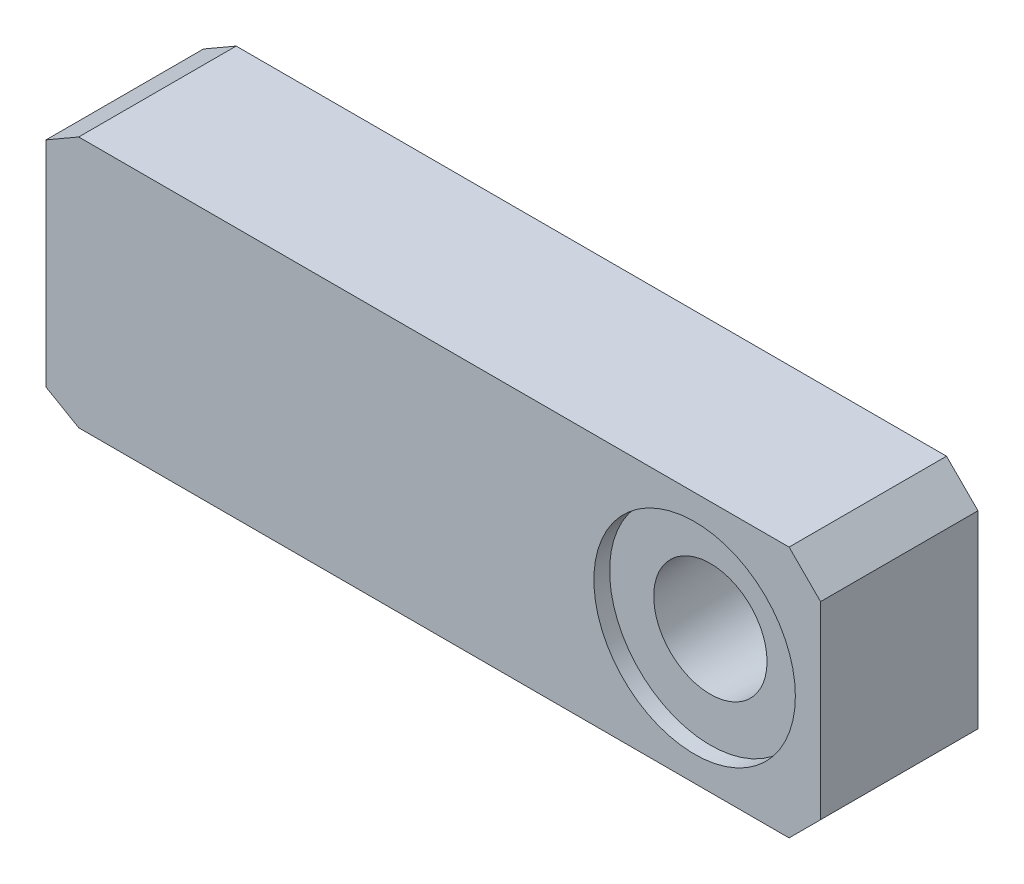
ISO-10303-21;
HEADER;
FILE_DESCRIPTION(('STEP AP214'),'2;1');
FILE_NAME('part.step','',(''),(''),'','','');
FILE_SCHEMA(('AUTOMOTIVE_DESIGN { 1 0 10303 214 1 1 1 1 }'));
ENDSEC;
DATA;
#1=APPLICATION_CONTEXT('core data for automotive mechanical design processes');
#2=APPLICATION_PROTOCOL_DEFINITION('international standard','automotive_design',2000,#1);
#3=PRODUCT_CONTEXT('',#1,'mechanical');
#4=PRODUCT('Part','Part','',(#3));
#5=PRODUCT_RELATED_PRODUCT_CATEGORY('part','',(#4));
#6=PRODUCT_DEFINITION_FORMATION('','',#4);
#7=PRODUCT_DEFINITION_CONTEXT('part definition',#1,'design');
#8=PRODUCT_DEFINITION('design','',#6,#7);
#9=PRODUCT_DEFINITION_SHAPE('','',#8);
#10=(LENGTH_UNIT() NAMED_UNIT(*) SI_UNIT(.MILLI.,.METRE.));
#11=(NAMED_UNIT(*) PLANE_ANGLE_UNIT() SI_UNIT($,.RADIAN.));
#12=(NAMED_UNIT(*) SI_UNIT($,.STERADIAN.) SOLID_ANGLE_UNIT());
#13=UNCERTAINTY_MEASURE_WITH_UNIT(LENGTH_MEASURE(1.E-05),#10,'distance_accuracy_value','');
#14=(GEOMETRIC_REPRESENTATION_CONTEXT(3) GLOBAL_UNCERTAINTY_ASSIGNED_CONTEXT((#13)) GLOBAL_UNIT_ASSIGNED_CONTEXT((#10,
#11,#12)) REPRESENTATION_CONTEXT('',''));
#15=CARTESIAN_POINT('',(0.,0.,0.));
#16=DIRECTION('',(0.,0.,1.));
#17=DIRECTION('',(1.,0.,0.));
#18=AXIS2_PLACEMENT_3D('',#15,#16,#17);
#19=CARTESIAN_POINT('',(0.,-20.,12.5));
#20=DIRECTION('',(1.,0.,0.));
#21=DIRECTION('',(0.,1.,0.));
#22=AXIS2_PLACEMENT_3D('',#19,#20,#21);
#23=PLANE('',#22);
#24=DIRECTION('',(0.,-1.,0.));
#25=VECTOR('',#24,1.);
#26=CARTESIAN_POINT('',(0.,-20.,-12.5));
#27=LINE('',#26,#25);
#28=CARTESIAN_POINT('',(0.,17.,-12.5));
#29=VERTEX_POINT('',#28);
#30=CARTESIAN_POINT('',(0.,-17.,-12.5));
#31=VERTEX_POINT('',#30);
#32=EDGE_CURVE('E124',#29,#31,#27,.T.);
#33=ORIENTED_EDGE('',*,*,#32,.T.);
#34=DIRECTION('',(0.,0.,1.));
#35=VECTOR('',#34,1.);
#36=CARTESIAN_POINT('',(0.,-17.,12.5));
#37=LINE('',#36,#35);
#38=CARTESIAN_POINT('',(0.,-17.,12.5));
#39=VERTEX_POINT('',#38);
#40=EDGE_CURVE('E107',#31,#39,#37,.T.);
#41=ORIENTED_EDGE('',*,*,#40,.T.);
#42=DIRECTION('',(0.,-1.,0.));
#43=VECTOR('',#42,1.);
#44=CARTESIAN_POINT('',(0.,-20.,12.5));
#45=LINE('',#44,#43);
#46=CARTESIAN_POINT('',(0.,17.,12.5));
#47=VERTEX_POINT('',#46);
#48=EDGE_CURVE('E133',#47,#39,#45,.T.);
#49=ORIENTED_EDGE('',*,*,#48,.F.);
#50=DIRECTION('',(0.,0.,-1.));
#51=VECTOR('',#50,1.);
#52=CARTESIAN_POINT('',(0.,17.,12.5));
#53=LINE('',#52,#51);
#54=EDGE_CURVE('E112',#47,#29,#53,.T.);
#55=ORIENTED_EDGE('',*,*,#54,.T.);
#56=EDGE_LOOP('',(#33,#41,#49,#55));
#57=FACE_BOUND('',#56,.T.);
#58=ADVANCED_FACE('F34',(#57),#23,.F.);
#59=CARTESIAN_POINT('',(0.,-20.,12.5));
#60=DIRECTION('',(0.,1.,0.));
#61=DIRECTION('',(-1.,0.,0.));
#62=AXIS2_PLACEMENT_3D('',#59,#60,#61);
#63=PLANE('',#62);
#64=DIRECTION('',(1.,0.,0.));
#65=VECTOR('',#64,1.);
#66=CARTESIAN_POINT('',(0.,-20.,-12.5));
#67=LINE('',#66,#65);
#68=CARTESIAN_POINT('',(5.1961524227066,-20.,-12.5));
#69=VERTEX_POINT('',#68);
#70=CARTESIAN_POINT('',(118.,-20.,-12.5));
#71=VERTEX_POINT('',#70);
#72=EDGE_CURVE('E116',#69,#71,#67,.T.);
#73=ORIENTED_EDGE('',*,*,#72,.T.);
#74=DIRECTION('',(0.,0.,1.));
#75=VECTOR('',#74,1.);
#76=CARTESIAN_POINT('',(118.,-20.,12.5));
#77=LINE('',#76,#75);
#78=CARTESIAN_POINT('',(118.,-20.,12.5));
#79=VERTEX_POINT('',#78);
#80=EDGE_CURVE('E57',#71,#79,#77,.T.);
#81=ORIENTED_EDGE('',*,*,#80,.T.);
#82=DIRECTION('',(1.,0.,0.));
#83=VECTOR('',#82,1.);
#84=CARTESIAN_POINT('',(0.,-20.,12.5));
#85=LINE('',#84,#83);
#86=CARTESIAN_POINT('',(5.1961524227066,-20.,12.5));
#87=VERTEX_POINT('',#86);
#88=EDGE_CURVE('E117',#87,#79,#85,.T.);
#89=ORIENTED_EDGE('',*,*,#88,.F.);
#90=DIRECTION('',(0.,0.,-1.));
#91=VECTOR('',#90,1.);
#92=CARTESIAN_POINT('',(5.1961524227066,-20.,12.5));
#93=LINE('',#92,#91);
#94=EDGE_CURVE('E106',#87,#69,#93,.T.);
#95=ORIENTED_EDGE('',*,*,#94,.T.);
#96=EDGE_LOOP('',(#73,#81,#89,#95));
#97=FACE_BOUND('',#96,.T.);
#98=ADVANCED_FACE('F115',(#97),#63,.F.);
#99=CARTESIAN_POINT('',(123.,-20.,12.5));
#100=DIRECTION('',(-1.,0.,0.));
#101=DIRECTION('',(0.,-1.,0.));
#102=AXIS2_PLACEMENT_3D('',#99,#100,#101);
#103=PLANE('',#102);
#104=DIRECTION('',(0.,1.,0.));
#105=VECTOR('',#104,1.);
#106=CARTESIAN_POINT('',(123.,-20.,12.5));
#107=LINE('',#106,#105);
#108=CARTESIAN_POINT('',(123.,-14.9999999999999,12.5));
#109=VERTEX_POINT('',#108);
#110=CARTESIAN_POINT('',(123.,15.,12.5));
#111=VERTEX_POINT('',#110);
#112=EDGE_CURVE('E159',#109,#111,#107,.T.);
#113=ORIENTED_EDGE('',*,*,#112,.F.);
#114=DIRECTION('',(0.,0.,-1.));
#115=VECTOR('',#114,1.);
#116=CARTESIAN_POINT('',(123.,-14.9999999999999,12.5));
#117=LINE('',#116,#115);
#118=CARTESIAN_POINT('',(123.,-14.9999999999999,-12.5));
#119=VERTEX_POINT('',#118);
#120=EDGE_CURVE('E149',#109,#119,#117,.T.);
#121=ORIENTED_EDGE('',*,*,#120,.T.);
#122=DIRECTION('',(0.,1.,0.));
#123=VECTOR('',#122,1.);
#124=CARTESIAN_POINT('',(123.,-20.,-12.5));
#125=LINE('',#124,#123);
#126=CARTESIAN_POINT('',(123.,15.,-12.5));
#127=VERTEX_POINT('',#126);
#128=EDGE_CURVE('E123',#119,#127,#125,.T.);
#129=ORIENTED_EDGE('',*,*,#128,.T.);
#130=DIRECTION('',(0.,0.,1.));
#131=VECTOR('',#130,1.);
#132=CARTESIAN_POINT('',(123.,15.,12.5));
#133=LINE('',#132,#131);
#134=EDGE_CURVE('E147',#127,#111,#133,.T.);
#135=ORIENTED_EDGE('',*,*,#134,.T.);
#136=EDGE_LOOP('',(#113,#121,#129,#135));
#137=FACE_BOUND('',#136,.T.);
#138=ADVANCED_FACE('F163',(#137),#103,.F.);
#139=CARTESIAN_POINT('',(0.,20.,12.5));
#140=DIRECTION('',(0.,-1.,0.));
#141=DIRECTION('',(0.,0.,-1.));
#142=AXIS2_PLACEMENT_3D('',#139,#140,#141);
#143=PLANE('',#142);
#144=DIRECTION('',(-1.,0.,0.));
#145=VECTOR('',#144,1.);
#146=CARTESIAN_POINT('',(0.,20.,12.5));
#147=LINE('',#146,#145);
#148=CARTESIAN_POINT('',(118.,20.,12.5));
#149=VERTEX_POINT('',#148);
#150=CARTESIAN_POINT('',(5.19615242270665,20.,12.5));
#151=VERTEX_POINT('',#150);
#152=EDGE_CURVE('E118',#149,#151,#147,.T.);
#153=ORIENTED_EDGE('',*,*,#152,.F.);
#154=DIRECTION('',(0.,0.,-1.));
#155=VECTOR('',#154,1.);
#156=CARTESIAN_POINT('',(118.,20.,12.5));
#157=LINE('',#156,#155);
#158=CARTESIAN_POINT('',(118.,20.,-12.5));
#159=VERTEX_POINT('',#158);
#160=EDGE_CURVE('E11',#149,#159,#157,.T.);
#161=ORIENTED_EDGE('',*,*,#160,.T.);
#162=DIRECTION('',(-1.,0.,0.));
#163=VECTOR('',#162,1.);
#164=CARTESIAN_POINT('',(0.,20.,-12.5));
#165=LINE('',#164,#163);
#166=CARTESIAN_POINT('',(5.19615242270665,20.,-12.5));
#167=VERTEX_POINT('',#166);
#168=EDGE_CURVE('E127',#159,#167,#165,.T.);
#169=ORIENTED_EDGE('',*,*,#168,.T.);
#170=DIRECTION('',(0.,0.,1.));
#171=VECTOR('',#170,1.);
#172=CARTESIAN_POINT('',(5.19615242270665,20.,12.5));
#173=LINE('',#172,#171);
#174=EDGE_CURVE('E144',#167,#151,#173,.T.);
#175=ORIENTED_EDGE('',*,*,#174,.T.);
#176=EDGE_LOOP('',(#153,#161,#169,#175));
#177=FACE_BOUND('',#176,.T.);
#178=ADVANCED_FACE('F215',(#177),#143,.F.);
#179=CARTESIAN_POINT('',(0.,0.,12.5));
#180=DIRECTION('',(0.,0.,-1.));
#181=DIRECTION('',(-1.,0.,0.));
#182=AXIS2_PLACEMENT_3D('',#179,#180,#181);
#183=PLANE('',#182);
#184=CARTESIAN_POINT('',(103.,0.,12.5));
#185=DIRECTION('',(0.,0.,1.));
#186=DIRECTION('',(1.,0.,0.));
#187=AXIS2_PLACEMENT_3D('',#184,#185,#186);
#188=CIRCLE('',#187,16.);
#189=CARTESIAN_POINT('',(119.,0.,12.5));
#190=VERTEX_POINT('',#189);
#191=EDGE_CURVE('E129',#190,#190,#188,.T.);
#192=ORIENTED_EDGE('',*,*,#191,.F.);
#193=EDGE_LOOP('',(#192));
#194=FACE_BOUND('',#193,.T.);
#195=ORIENTED_EDGE('',*,*,#88,.T.);
#196=DIRECTION('',(-0.707106781186547,-0.707106781186548,0.));
#197=VECTOR('',#196,1.);
#198=CARTESIAN_POINT('',(123.,-14.9999999999999,12.5));
#199=LINE('',#198,#197);
#200=EDGE_CURVE('E42',#79,#109,#199,.F.);
#201=ORIENTED_EDGE('',*,*,#200,.T.);
#202=ORIENTED_EDGE('',*,*,#112,.T.);
#203=DIRECTION('',(0.707106781186549,-0.707106781186547,0.));
#204=VECTOR('',#203,1.);
#205=CARTESIAN_POINT('',(118.,20.,12.5));
#206=LINE('',#205,#204);
#207=EDGE_CURVE('E49',#111,#149,#206,.F.);
#208=ORIENTED_EDGE('',*,*,#207,.T.);
#209=ORIENTED_EDGE('',*,*,#152,.T.);
#210=DIRECTION('',(0.866025403784439,0.5,0.));
#211=VECTOR('',#210,1.);
#212=CARTESIAN_POINT('',(0.,17.,12.5));
#213=LINE('',#212,#211);
#214=EDGE_CURVE('E140',#151,#47,#213,.F.);
#215=ORIENTED_EDGE('',*,*,#214,.T.);
#216=ORIENTED_EDGE('',*,*,#48,.T.);
#217=DIRECTION('',(-0.866025403784437,0.500000000000003,0.));
#218=VECTOR('',#217,1.);
#219=CARTESIAN_POINT('',(5.1961524227066,-20.,12.5));
#220=LINE('',#219,#218);
#221=EDGE_CURVE('E142',#39,#87,#220,.F.);
#222=ORIENTED_EDGE('',*,*,#221,.T.);
#223=EDGE_LOOP('',(#195,#201,#202,#208,#209,#215,#216,#222));
#224=FACE_BOUND('',#223,.T.);
#225=ADVANCED_FACE('F158',(#194,#224),#183,.F.);
#226=CARTESIAN_POINT('',(0.,0.,-12.5));
#227=DIRECTION('',(0.,0.,-1.));
#228=DIRECTION('',(-1.,0.,0.));
#229=AXIS2_PLACEMENT_3D('',#226,#227,#228);
#230=PLANE('',#229);
#231=CARTESIAN_POINT('',(103.,0.,-12.5));
#232=DIRECTION('',(0.,0.,1.));
#233=DIRECTION('',(1.,0.,0.));
#234=AXIS2_PLACEMENT_3D('',#231,#232,#233);
#235=CIRCLE('',#234,16.);
#236=CARTESIAN_POINT('',(119.,0.,-12.5));
#237=VERTEX_POINT('',#236);
#238=EDGE_CURVE('E328',#237,#237,#235,.T.);
#239=ORIENTED_EDGE('',*,*,#238,.T.);
#240=EDGE_LOOP('',(#239));
#241=FACE_BOUND('',#240,.T.);
#242=ORIENTED_EDGE('',*,*,#128,.F.);
#243=DIRECTION('',(0.707106781186547,0.707106781186548,0.));
#244=VECTOR('',#243,1.);
#245=CARTESIAN_POINT('',(69.,-69.,-12.5));
#246=LINE('',#245,#244);
#247=EDGE_CURVE('E122',#119,#71,#246,.F.);
#248=ORIENTED_EDGE('',*,*,#247,.T.);
#249=ORIENTED_EDGE('',*,*,#72,.F.);
#250=DIRECTION('',(0.866025403784437,-0.500000000000003,0.));
#251=VECTOR('',#250,1.);
#252=CARTESIAN_POINT('',(-7.36121593216775,-12.75,-12.5));
#253=LINE('',#252,#251);
#254=EDGE_CURVE('E102',#69,#31,#253,.F.);
#255=ORIENTED_EDGE('',*,*,#254,.T.);
#256=ORIENTED_EDGE('',*,*,#32,.F.);
#257=DIRECTION('',(-0.866025403784439,-0.5,0.));
#258=VECTOR('',#257,1.);
#259=CARTESIAN_POINT('',(-7.36121593216773,12.75,-12.5));
#260=LINE('',#259,#258);
#261=EDGE_CURVE('E113',#29,#167,#260,.F.);
#262=ORIENTED_EDGE('',*,*,#261,.T.);
#263=ORIENTED_EDGE('',*,*,#168,.F.);
#264=DIRECTION('',(-0.707106781186549,0.707106781186547,0.));
#265=VECTOR('',#264,1.);
#266=CARTESIAN_POINT('',(68.9999999999998,69.,-12.5));
#267=LINE('',#266,#265);
#268=EDGE_CURVE('E152',#159,#127,#267,.F.);
#269=ORIENTED_EDGE('',*,*,#268,.T.);
#270=EDGE_LOOP('',(#242,#248,#249,#255,#256,#262,#263,#269));
#271=FACE_BOUND('',#270,.T.);
#272=ADVANCED_FACE('F121',(#241,#271),#230,.T.);
#273=CARTESIAN_POINT('',(103.,0.,15.136672694938));
#274=DIRECTION('',(0.,0.,1.));
#275=DIRECTION('',(1.,0.,0.));
#276=AXIS2_PLACEMENT_3D('',#273,#274,#275);
#277=CYLINDRICAL_SURFACE('',#276,16.);
#278=ORIENTED_EDGE('',*,*,#191,.T.);
#279=EDGE_LOOP('',(#278));
#280=FACE_BOUND('',#279,.T.);
#281=CARTESIAN_POINT('',(103.,0.,10.));
#282=DIRECTION('',(0.,0.,1.));
#283=DIRECTION('',(1.,0.,0.));
#284=AXIS2_PLACEMENT_3D('',#281,#282,#283);
#285=CIRCLE('',#284,16.);
#286=CARTESIAN_POINT('',(119.,0.,10.));
#287=VERTEX_POINT('',#286);
#288=EDGE_CURVE('E317',#287,#287,#285,.T.);
#289=ORIENTED_EDGE('',*,*,#288,.F.);
#290=EDGE_LOOP('',(#289));
#291=FACE_BOUND('',#290,.T.);
#292=ADVANCED_FACE('F208',(#280,#291),#277,.F.);
#293=CARTESIAN_POINT('',(87.,0.,10.));
#294=DIRECTION('',(0.,0.,1.));
#295=DIRECTION('',(1.,0.,0.));
#296=AXIS2_PLACEMENT_3D('',#293,#294,#295);
#297=PLANE('',#296);
#298=ORIENTED_EDGE('',*,*,#288,.T.);
#299=EDGE_LOOP('',(#298));
#300=FACE_BOUND('',#299,.T.);
#301=CARTESIAN_POINT('',(103.,0.,10.));
#302=DIRECTION('',(0.,0.,1.));
#303=DIRECTION('',(1.,0.,0.));
#304=AXIS2_PLACEMENT_3D('',#301,#302,#303);
#305=CIRCLE('',#304,8.99999999999999);
#306=CARTESIAN_POINT('',(112.,0.,10.));
#307=VERTEX_POINT('',#306);
#308=EDGE_CURVE('E320',#307,#307,#305,.T.);
#309=ORIENTED_EDGE('',*,*,#308,.F.);
#310=EDGE_LOOP('',(#309));
#311=FACE_BOUND('',#310,.T.);
#312=ADVANCED_FACE('F204',(#300,#311),#297,.T.);
#313=CARTESIAN_POINT('',(103.,0.,-10.));
#314=DIRECTION('',(0.,0.,-1.));
#315=DIRECTION('',(-1.,0.,0.));
#316=AXIS2_PLACEMENT_3D('',#313,#314,#315);
#317=CONICAL_SURFACE('',#316,9.99999999999999,0.0499583957219428);
#318=ORIENTED_EDGE('',*,*,#308,.T.);
#319=EDGE_LOOP('',(#318));
#320=FACE_BOUND('',#319,.T.);
#321=CARTESIAN_POINT('',(103.,0.,-10.));
#322=DIRECTION('',(0.,0.,1.));
#323=DIRECTION('',(1.,0.,0.));
#324=AXIS2_PLACEMENT_3D('',#321,#322,#323);
#325=CIRCLE('',#324,9.99999999999999);
#326=CARTESIAN_POINT('',(113.,0.,-10.));
#327=VERTEX_POINT('',#326);
#328=EDGE_CURVE('E323',#327,#327,#325,.T.);
#329=ORIENTED_EDGE('',*,*,#328,.F.);
#330=EDGE_LOOP('',(#329));
#331=FACE_BOUND('',#330,.T.);
#332=ADVANCED_FACE('F196',(#320,#331),#317,.F.);
#333=CARTESIAN_POINT('',(93.,0.,-10.));
#334=DIRECTION('',(0.,0.,-1.));
#335=DIRECTION('',(-1.,0.,0.));
#336=AXIS2_PLACEMENT_3D('',#333,#334,#335);
#337=PLANE('',#336);
#338=ORIENTED_EDGE('',*,*,#328,.T.);
#339=EDGE_LOOP('',(#338));
#340=FACE_BOUND('',#339,.T.);
#341=CARTESIAN_POINT('',(103.,0.,-10.));
#342=DIRECTION('',(0.,0.,1.));
#343=DIRECTION('',(1.,0.,0.));
#344=AXIS2_PLACEMENT_3D('',#341,#342,#343);
#345=CIRCLE('',#344,16.);
#346=CARTESIAN_POINT('',(119.,0.,-10.));
#347=VERTEX_POINT('',#346);
#348=EDGE_CURVE('E326',#347,#347,#345,.T.);
#349=ORIENTED_EDGE('',*,*,#348,.F.);
#350=EDGE_LOOP('',(#349));
#351=FACE_BOUND('',#350,.T.);
#352=ADVANCED_FACE('F190',(#340,#351),#337,.T.);
#353=CARTESIAN_POINT('',(103.,0.,15.136672694938));
#354=DIRECTION('',(0.,0.,1.));
#355=DIRECTION('',(1.,0.,0.));
#356=AXIS2_PLACEMENT_3D('',#353,#354,#355);
#357=CYLINDRICAL_SURFACE('',#356,16.);
#358=ORIENTED_EDGE('',*,*,#348,.T.);
#359=EDGE_LOOP('',(#358));
#360=FACE_BOUND('',#359,.T.);
#361=ORIENTED_EDGE('',*,*,#238,.F.);
#362=EDGE_LOOP('',(#361));
#363=FACE_BOUND('',#362,.T.);
#364=ADVANCED_FACE('F186',(#360,#363),#357,.F.);
#365=CARTESIAN_POINT('',(5.1961524227066,-20.,12.5));
#366=DIRECTION('',(0.500000000000003,0.866025403784437,0.));
#367=DIRECTION('',(0.,0.,-1.));
#368=AXIS2_PLACEMENT_3D('',#365,#366,#367);
#369=PLANE('',#368);
#370=ORIENTED_EDGE('',*,*,#221,.F.);
#371=ORIENTED_EDGE('',*,*,#40,.F.);
#372=ORIENTED_EDGE('',*,*,#254,.F.);
#373=ORIENTED_EDGE('',*,*,#94,.F.);
#374=EDGE_LOOP('',(#370,#371,#372,#373));
#375=FACE_BOUND('',#374,.T.);
#376=ADVANCED_FACE('F105',(#375),#369,.F.);
#377=CARTESIAN_POINT('',(0.,17.,12.5));
#378=DIRECTION('',(0.5,-0.866025403784438,0.));
#379=DIRECTION('',(0.,0.,-1.));
#380=AXIS2_PLACEMENT_3D('',#377,#378,#379);
#381=PLANE('',#380);
#382=ORIENTED_EDGE('',*,*,#214,.F.);
#383=ORIENTED_EDGE('',*,*,#174,.F.);
#384=ORIENTED_EDGE('',*,*,#261,.F.);
#385=ORIENTED_EDGE('',*,*,#54,.F.);
#386=EDGE_LOOP('',(#382,#383,#384,#385));
#387=FACE_BOUND('',#386,.T.);
#388=ADVANCED_FACE('F168',(#387),#381,.F.);
#389=CARTESIAN_POINT('',(123.,-14.9999999999999,12.5));
#390=DIRECTION('',(-0.707106781186548,0.707106781186547,0.));
#391=DIRECTION('',(0.,0.,-1.));
#392=AXIS2_PLACEMENT_3D('',#389,#390,#391);
#393=PLANE('',#392);
#394=ORIENTED_EDGE('',*,*,#200,.F.);
#395=ORIENTED_EDGE('',*,*,#80,.F.);
#396=ORIENTED_EDGE('',*,*,#247,.F.);
#397=ORIENTED_EDGE('',*,*,#120,.F.);
#398=EDGE_LOOP('',(#394,#395,#396,#397));
#399=FACE_BOUND('',#398,.T.);
#400=ADVANCED_FACE('F166',(#399),#393,.F.);
#401=CARTESIAN_POINT('',(118.,20.,12.5));
#402=DIRECTION('',(-0.707106781186546,-0.707106781186548,0.));
#403=DIRECTION('',(0.,0.,-1.));
#404=AXIS2_PLACEMENT_3D('',#401,#402,#403);
#405=PLANE('',#404);
#406=ORIENTED_EDGE('',*,*,#207,.F.);
#407=ORIENTED_EDGE('',*,*,#134,.F.);
#408=ORIENTED_EDGE('',*,*,#268,.F.);
#409=ORIENTED_EDGE('',*,*,#160,.F.);
#410=EDGE_LOOP('',(#406,#407,#408,#409));
#411=FACE_BOUND('',#410,.T.);
#412=ADVANCED_FACE('F36',(#411),#405,.F.);
#413=CLOSED_SHELL('',(#58,#98,#138,#178,#225,#272,#292,#312,#332,#352,#364,#376,#388,#400,#412));
#414=MANIFOLD_SOLID_BREP('B2',#413);
#415=ADVANCED_BREP_SHAPE_REPRESENTATION('',(#18,#414),#14);
#416=SHAPE_DEFINITION_REPRESENTATION(#9,#415);
ENDSEC;
END-ISO-10303-21;
